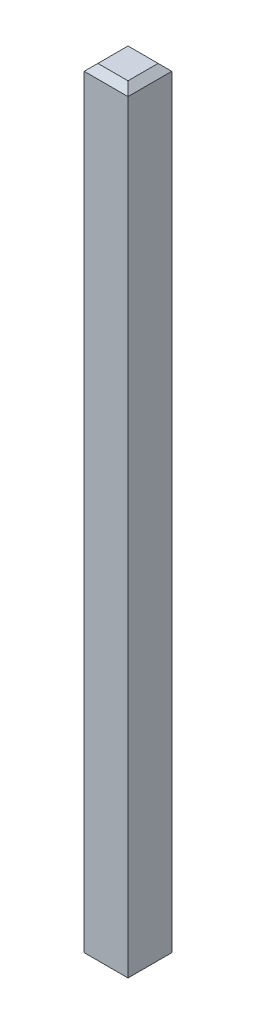
ISO-10303-21;
HEADER;
FILE_DESCRIPTION(('STEP AP214'),'2;1');
FILE_NAME('part.step','',(''),(''),'','','');
FILE_SCHEMA(('AUTOMOTIVE_DESIGN { 1 0 10303 214 1 1 1 1 }'));
ENDSEC;
DATA;
#1=APPLICATION_CONTEXT('core data for automotive mechanical design processes');
#2=APPLICATION_PROTOCOL_DEFINITION('international standard','automotive_design',2000,#1);
#3=PRODUCT_CONTEXT('',#1,'mechanical');
#4=PRODUCT('Part','Part','',(#3));
#5=PRODUCT_RELATED_PRODUCT_CATEGORY('part','',(#4));
#6=PRODUCT_DEFINITION_FORMATION('','',#4);
#7=PRODUCT_DEFINITION_CONTEXT('part definition',#1,'design');
#8=PRODUCT_DEFINITION('design','',#6,#7);
#9=PRODUCT_DEFINITION_SHAPE('','',#8);
#10=(LENGTH_UNIT() NAMED_UNIT(*) SI_UNIT(.MILLI.,.METRE.));
#11=(NAMED_UNIT(*) PLANE_ANGLE_UNIT() SI_UNIT($,.RADIAN.));
#12=(NAMED_UNIT(*) SI_UNIT($,.STERADIAN.) SOLID_ANGLE_UNIT());
#13=UNCERTAINTY_MEASURE_WITH_UNIT(LENGTH_MEASURE(1.E-05),#10,'distance_accuracy_value','');
#14=(GEOMETRIC_REPRESENTATION_CONTEXT(3) GLOBAL_UNCERTAINTY_ASSIGNED_CONTEXT((#13)) GLOBAL_UNIT_ASSIGNED_CONTEXT((#10,
#11,#12)) REPRESENTATION_CONTEXT('',''));
#15=CARTESIAN_POINT('',(0.,0.,0.));
#16=DIRECTION('',(0.,0.,1.));
#17=DIRECTION('',(1.,0.,0.));
#18=AXIS2_PLACEMENT_3D('',#15,#16,#17);
#19=CARTESIAN_POINT('',(0.320000000000001,11.35,-0.32));
#20=DIRECTION('',(-1.,0.,0.));
#21=DIRECTION('',(0.,0.,1.));
#22=AXIS2_PLACEMENT_3D('',#19,#20,#21);
#23=PLANE('',#22);
#24=DIRECTION('',(0.,-1.,0.));
#25=VECTOR('',#24,1.);
#26=CARTESIAN_POINT('',(0.320000000000001,11.35,0.32));
#27=LINE('',#26,#25);
#28=CARTESIAN_POINT('',(0.320000000000001,11.25,0.32));
#29=VERTEX_POINT('',#28);
#30=CARTESIAN_POINT('',(0.320000000000001,0.0999999999999994,0.32));
#31=VERTEX_POINT('',#30);
#32=EDGE_CURVE('E133',#29,#31,#27,.T.);
#33=ORIENTED_EDGE('',*,*,#32,.T.);
#34=DIRECTION('',(0.,0.,-1.));
#35=VECTOR('',#34,1.);
#36=CARTESIAN_POINT('',(0.320000000000001,0.0999999999999994,-0.32));
#37=LINE('',#36,#35);
#38=CARTESIAN_POINT('',(0.320000000000001,0.0999999999999994,-0.32));
#39=VERTEX_POINT('',#38);
#40=EDGE_CURVE('E153',#31,#39,#37,.T.);
#41=ORIENTED_EDGE('',*,*,#40,.T.);
#42=DIRECTION('',(0.,-1.,0.));
#43=VECTOR('',#42,1.);
#44=CARTESIAN_POINT('',(0.320000000000001,11.35,-0.32));
#45=LINE('',#44,#43);
#46=CARTESIAN_POINT('',(0.320000000000001,11.25,-0.32));
#47=VERTEX_POINT('',#46);
#48=EDGE_CURVE('E116',#47,#39,#45,.T.);
#49=ORIENTED_EDGE('',*,*,#48,.F.);
#50=DIRECTION('',(0.,0.,1.));
#51=VECTOR('',#50,1.);
#52=CARTESIAN_POINT('',(0.320000000000001,11.25,0.32));
#53=LINE('',#52,#51);
#54=EDGE_CURVE('E151',#47,#29,#53,.T.);
#55=ORIENTED_EDGE('',*,*,#54,.T.);
#56=EDGE_LOOP('',(#33,#41,#49,#55));
#57=FACE_BOUND('',#56,.T.);
#58=ADVANCED_FACE('F33',(#57),#23,.F.);
#59=CARTESIAN_POINT('',(-0.319999999999999,11.35,-0.32));
#60=DIRECTION('',(0.,0.,1.));
#61=DIRECTION('',(1.,0.,0.));
#62=AXIS2_PLACEMENT_3D('',#59,#60,#61);
#63=PLANE('',#62);
#64=ORIENTED_EDGE('',*,*,#48,.T.);
#65=DIRECTION('',(-1.,0.,0.));
#66=VECTOR('',#65,1.);
#67=CARTESIAN_POINT('',(-0.319999999999999,0.0999999999999994,-0.32));
#68=LINE('',#67,#66);
#69=CARTESIAN_POINT('',(-0.319999999999999,0.0999999999999994,-0.32));
#70=VERTEX_POINT('',#69);
#71=EDGE_CURVE('E115',#39,#70,#68,.T.);
#72=ORIENTED_EDGE('',*,*,#71,.T.);
#73=DIRECTION('',(0.,-1.,0.));
#74=VECTOR('',#73,1.);
#75=CARTESIAN_POINT('',(-0.319999999999999,11.35,-0.32));
#76=LINE('',#75,#74);
#77=CARTESIAN_POINT('',(-0.319999999999999,11.25,-0.32));
#78=VERTEX_POINT('',#77);
#79=EDGE_CURVE('E122',#78,#70,#76,.T.);
#80=ORIENTED_EDGE('',*,*,#79,.F.);
#81=DIRECTION('',(1.,0.,0.));
#82=VECTOR('',#81,1.);
#83=CARTESIAN_POINT('',(0.320000000000001,11.25,-0.32));
#84=LINE('',#83,#82);
#85=EDGE_CURVE('E109',#78,#47,#84,.T.);
#86=ORIENTED_EDGE('',*,*,#85,.T.);
#87=EDGE_LOOP('',(#64,#72,#80,#86));
#88=FACE_BOUND('',#87,.T.);
#89=ADVANCED_FACE('F129',(#88),#63,.F.);
#90=CARTESIAN_POINT('',(-0.319999999999999,11.35,-0.32));
#91=DIRECTION('',(1.,0.,0.));
#92=DIRECTION('',(0.,0.,-1.));
#93=AXIS2_PLACEMENT_3D('',#90,#91,#92);
#94=PLANE('',#93);
#95=ORIENTED_EDGE('',*,*,#79,.T.);
#96=DIRECTION('',(0.,0.,1.));
#97=VECTOR('',#96,1.);
#98=CARTESIAN_POINT('',(-0.319999999999999,0.0999999999999994,-0.32));
#99=LINE('',#98,#97);
#100=CARTESIAN_POINT('',(-0.319999999999999,0.0999999999999994,0.32));
#101=VERTEX_POINT('',#100);
#102=EDGE_CURVE('E125',#70,#101,#99,.T.);
#103=ORIENTED_EDGE('',*,*,#102,.T.);
#104=DIRECTION('',(0.,-1.,0.));
#105=VECTOR('',#104,1.);
#106=CARTESIAN_POINT('',(-0.319999999999999,11.35,0.32));
#107=LINE('',#106,#105);
#108=CARTESIAN_POINT('',(-0.319999999999999,11.25,0.32));
#109=VERTEX_POINT('',#108);
#110=EDGE_CURVE('E124',#109,#101,#107,.T.);
#111=ORIENTED_EDGE('',*,*,#110,.F.);
#112=DIRECTION('',(0.,0.,-1.));
#113=VECTOR('',#112,1.);
#114=CARTESIAN_POINT('',(-0.319999999999999,11.25,-0.32));
#115=LINE('',#114,#113);
#116=EDGE_CURVE('E102',#109,#78,#115,.T.);
#117=ORIENTED_EDGE('',*,*,#116,.T.);
#118=EDGE_LOOP('',(#95,#103,#111,#117));
#119=FACE_BOUND('',#118,.T.);
#120=ADVANCED_FACE('F121',(#119),#94,.F.);
#121=CARTESIAN_POINT('',(-0.319999999999999,11.35,0.32));
#122=DIRECTION('',(0.,0.,-1.));
#123=DIRECTION('',(-1.,0.,0.));
#124=AXIS2_PLACEMENT_3D('',#121,#122,#123);
#125=PLANE('',#124);
#126=ORIENTED_EDGE('',*,*,#110,.T.);
#127=DIRECTION('',(1.,0.,0.));
#128=VECTOR('',#127,1.);
#129=CARTESIAN_POINT('',(-0.319999999999999,0.0999999999999994,0.32));
#130=LINE('',#129,#128);
#131=EDGE_CURVE('E149',#101,#31,#130,.T.);
#132=ORIENTED_EDGE('',*,*,#131,.T.);
#133=ORIENTED_EDGE('',*,*,#32,.F.);
#134=DIRECTION('',(-1.,0.,0.));
#135=VECTOR('',#134,1.);
#136=CARTESIAN_POINT('',(-0.319999999999999,11.25,0.32));
#137=LINE('',#136,#135);
#138=EDGE_CURVE('E147',#29,#109,#137,.T.);
#139=ORIENTED_EDGE('',*,*,#138,.T.);
#140=EDGE_LOOP('',(#126,#132,#133,#139));
#141=FACE_BOUND('',#140,.T.);
#142=ADVANCED_FACE('F182',(#141),#125,.F.);
#143=CARTESIAN_POINT('',(0.,11.35,0.));
#144=DIRECTION('',(0.,1.,0.));
#145=DIRECTION('',(0.,0.,1.));
#146=AXIS2_PLACEMENT_3D('',#143,#144,#145);
#147=PLANE('',#146);
#148=DIRECTION('',(-1.,0.,0.));
#149=VECTOR('',#148,1.);
#150=CARTESIAN_POINT('',(-0.319999999999999,11.35,-0.219999999999999));
#151=LINE('',#150,#149);
#152=CARTESIAN_POINT('',(0.22,11.35,-0.219999999999999));
#153=VERTEX_POINT('',#152);
#154=CARTESIAN_POINT('',(-0.219999999999998,11.35,-0.219999999999999));
#155=VERTEX_POINT('',#154);
#156=EDGE_CURVE('E42',#153,#155,#151,.T.);
#157=ORIENTED_EDGE('',*,*,#156,.T.);
#158=DIRECTION('',(0.,0.,1.));
#159=VECTOR('',#158,1.);
#160=CARTESIAN_POINT('',(-0.219999999999998,11.35,0.32));
#161=LINE('',#160,#159);
#162=CARTESIAN_POINT('',(-0.219999999999998,11.35,0.219999999999999));
#163=VERTEX_POINT('',#162);
#164=EDGE_CURVE('E11',#155,#163,#161,.T.);
#165=ORIENTED_EDGE('',*,*,#164,.T.);
#166=DIRECTION('',(1.,0.,0.));
#167=VECTOR('',#166,1.);
#168=CARTESIAN_POINT('',(0.320000000000001,11.35,0.219999999999999));
#169=LINE('',#168,#167);
#170=CARTESIAN_POINT('',(0.22,11.35,0.219999999999999));
#171=VERTEX_POINT('',#170);
#172=EDGE_CURVE('E155',#163,#171,#169,.T.);
#173=ORIENTED_EDGE('',*,*,#172,.T.);
#174=DIRECTION('',(0.,0.,-1.));
#175=VECTOR('',#174,1.);
#176=CARTESIAN_POINT('',(0.22,11.35,-0.32));
#177=LINE('',#176,#175);
#178=EDGE_CURVE('E53',#171,#153,#177,.T.);
#179=ORIENTED_EDGE('',*,*,#178,.T.);
#180=EDGE_LOOP('',(#157,#165,#173,#179));
#181=FACE_BOUND('',#180,.T.);
#182=ADVANCED_FACE('F275',(#181),#147,.T.);
#183=CARTESIAN_POINT('',(0.,0.,0.));
#184=DIRECTION('',(0.,1.,0.));
#185=DIRECTION('',(0.,0.,1.));
#186=AXIS2_PLACEMENT_3D('',#183,#184,#185);
#187=PLANE('',#186);
#188=DIRECTION('',(0.,0.,-1.));
#189=VECTOR('',#188,1.);
#190=CARTESIAN_POINT('',(-0.220000000000001,0.,0.));
#191=LINE('',#190,#189);
#192=CARTESIAN_POINT('',(-0.220000000000001,0.,0.220000000000002));
#193=VERTEX_POINT('',#192);
#194=CARTESIAN_POINT('',(-0.220000000000001,0.,-0.220000000000002));
#195=VERTEX_POINT('',#194);
#196=EDGE_CURVE('E142',#193,#195,#191,.T.);
#197=ORIENTED_EDGE('',*,*,#196,.T.);
#198=DIRECTION('',(1.,0.,0.));
#199=VECTOR('',#198,1.);
#200=CARTESIAN_POINT('',(0.,0.,-0.220000000000002));
#201=LINE('',#200,#199);
#202=CARTESIAN_POINT('',(0.220000000000003,0.,-0.220000000000002));
#203=VERTEX_POINT('',#202);
#204=EDGE_CURVE('E126',#195,#203,#201,.T.);
#205=ORIENTED_EDGE('',*,*,#204,.T.);
#206=DIRECTION('',(0.,0.,1.));
#207=VECTOR('',#206,1.);
#208=CARTESIAN_POINT('',(0.220000000000003,0.,0.));
#209=LINE('',#208,#207);
#210=CARTESIAN_POINT('',(0.220000000000003,0.,0.220000000000002));
#211=VERTEX_POINT('',#210);
#212=EDGE_CURVE('E138',#203,#211,#209,.T.);
#213=ORIENTED_EDGE('',*,*,#212,.T.);
#214=DIRECTION('',(-1.,0.,0.));
#215=VECTOR('',#214,1.);
#216=CARTESIAN_POINT('',(0.,0.,0.220000000000002));
#217=LINE('',#216,#215);
#218=EDGE_CURVE('E140',#211,#193,#217,.T.);
#219=ORIENTED_EDGE('',*,*,#218,.T.);
#220=EDGE_LOOP('',(#197,#205,#213,#219));
#221=FACE_BOUND('',#220,.T.);
#222=ADVANCED_FACE('F196',(#221),#187,.F.);
#223=CARTESIAN_POINT('',(-0.319999999999999,0.0999999999999994,0.32));
#224=DIRECTION('',(0.,0.707106781186541,-0.707106781186554));
#225=DIRECTION('',(1.,0.,0.));
#226=AXIS2_PLACEMENT_3D('',#223,#224,#225);
#227=PLANE('',#226);
#228=DIRECTION('',(0.577350269189622,-0.577350269189632,-0.577350269189622));
#229=VECTOR('',#228,1.);
#230=CARTESIAN_POINT('',(-0.319999999999999,0.0999999999999994,0.32));
#231=LINE('',#230,#229);
#232=EDGE_CURVE('E163',#193,#101,#231,.F.);
#233=ORIENTED_EDGE('',*,*,#232,.F.);
#234=ORIENTED_EDGE('',*,*,#218,.F.);
#235=DIRECTION('',(-0.577350269189622,-0.577350269189632,-0.577350269189622));
#236=VECTOR('',#235,1.);
#237=CARTESIAN_POINT('',(0.10666666666667,-0.113333333333335,0.106666666666669));
#238=LINE('',#237,#236);
#239=EDGE_CURVE('E166',#31,#211,#238,.T.);
#240=ORIENTED_EDGE('',*,*,#239,.F.);
#241=ORIENTED_EDGE('',*,*,#131,.F.);
#242=EDGE_LOOP('',(#233,#234,#240,#241));
#243=FACE_BOUND('',#242,.T.);
#244=ADVANCED_FACE('F186',(#243),#227,.F.);
#245=CARTESIAN_POINT('',(0.320000000000001,0.0999999999999994,-0.32));
#246=DIRECTION('',(-0.707106781186554,0.707106781186541,0.));
#247=DIRECTION('',(0.,0.,-1.));
#248=AXIS2_PLACEMENT_3D('',#245,#246,#247);
#249=PLANE('',#248);
#250=ORIENTED_EDGE('',*,*,#239,.T.);
#251=ORIENTED_EDGE('',*,*,#212,.F.);
#252=DIRECTION('',(0.577350269189622,0.577350269189632,-0.577350269189622));
#253=VECTOR('',#252,1.);
#254=CARTESIAN_POINT('',(0.320000000000001,0.0999999999999994,-0.32));
#255=LINE('',#254,#253);
#256=EDGE_CURVE('E161',#39,#203,#255,.F.);
#257=ORIENTED_EDGE('',*,*,#256,.F.);
#258=ORIENTED_EDGE('',*,*,#40,.F.);
#259=EDGE_LOOP('',(#250,#251,#257,#258));
#260=FACE_BOUND('',#259,.T.);
#261=ADVANCED_FACE('F202',(#260),#249,.F.);
#262=CARTESIAN_POINT('',(-0.319999999999999,0.0999999999999994,-0.32));
#263=DIRECTION('',(0.707106781186554,0.707106781186541,0.));
#264=DIRECTION('',(0.,0.,1.));
#265=AXIS2_PLACEMENT_3D('',#262,#263,#264);
#266=PLANE('',#265);
#267=ORIENTED_EDGE('',*,*,#232,.T.);
#268=ORIENTED_EDGE('',*,*,#102,.F.);
#269=DIRECTION('',(0.577350269189622,-0.577350269189632,0.577350269189622));
#270=VECTOR('',#269,1.);
#271=CARTESIAN_POINT('',(-0.319999999999999,0.0999999999999994,-0.32));
#272=LINE('',#271,#270);
#273=EDGE_CURVE('E159',#195,#70,#272,.F.);
#274=ORIENTED_EDGE('',*,*,#273,.F.);
#275=ORIENTED_EDGE('',*,*,#196,.F.);
#276=EDGE_LOOP('',(#267,#268,#274,#275));
#277=FACE_BOUND('',#276,.T.);
#278=ADVANCED_FACE('F192',(#277),#266,.F.);
#279=CARTESIAN_POINT('',(-0.319999999999999,0.0999999999999994,-0.32));
#280=DIRECTION('',(0.,0.707106781186541,0.707106781186554));
#281=DIRECTION('',(-1.,0.,0.));
#282=AXIS2_PLACEMENT_3D('',#279,#280,#281);
#283=PLANE('',#282);
#284=ORIENTED_EDGE('',*,*,#256,.T.);
#285=ORIENTED_EDGE('',*,*,#204,.F.);
#286=ORIENTED_EDGE('',*,*,#273,.T.);
#287=ORIENTED_EDGE('',*,*,#71,.F.);
#288=EDGE_LOOP('',(#284,#285,#286,#287));
#289=FACE_BOUND('',#288,.T.);
#290=ADVANCED_FACE('F198',(#289),#283,.F.);
#291=CARTESIAN_POINT('',(0.22,11.35,0.));
#292=DIRECTION('',(0.707106781186547,0.707106781186547,0.));
#293=DIRECTION('',(0.,0.,1.));
#294=AXIS2_PLACEMENT_3D('',#291,#292,#293);
#295=PLANE('',#294);
#296=DIRECTION('',(-0.577350269189626,0.577350269189626,-0.577350269189626));
#297=VECTOR('',#296,1.);
#298=CARTESIAN_POINT('',(0.146666666666666,11.4233333333333,0.146666666666666));
#299=LINE('',#298,#297);
#300=EDGE_CURVE('E105',#29,#171,#299,.T.);
#301=ORIENTED_EDGE('',*,*,#300,.F.);
#302=ORIENTED_EDGE('',*,*,#54,.F.);
#303=DIRECTION('',(-0.577350269189626,0.577350269189626,0.577350269189626));
#304=VECTOR('',#303,1.);
#305=CARTESIAN_POINT('',(0.146666666666667,11.4233333333333,-0.146666666666666));
#306=LINE('',#305,#304);
#307=EDGE_CURVE('E37',#153,#47,#306,.F.);
#308=ORIENTED_EDGE('',*,*,#307,.F.);
#309=ORIENTED_EDGE('',*,*,#178,.F.);
#310=EDGE_LOOP('',(#301,#302,#308,#309));
#311=FACE_BOUND('',#310,.T.);
#312=ADVANCED_FACE('F35',(#311),#295,.T.);
#313=CARTESIAN_POINT('',(0.,11.35,-0.219999999999999));
#314=DIRECTION('',(0.,0.707106781186547,-0.707106781186547));
#315=DIRECTION('',(1.,0.,0.));
#316=AXIS2_PLACEMENT_3D('',#313,#314,#315);
#317=PLANE('',#316);
#318=ORIENTED_EDGE('',*,*,#307,.T.);
#319=ORIENTED_EDGE('',*,*,#85,.F.);
#320=DIRECTION('',(0.577350269189626,0.577350269189626,0.577350269189626));
#321=VECTOR('',#320,1.);
#322=CARTESIAN_POINT('',(-0.146666666666665,11.4233333333333,-0.146666666666666));
#323=LINE('',#322,#321);
#324=EDGE_CURVE('E98',#155,#78,#323,.F.);
#325=ORIENTED_EDGE('',*,*,#324,.F.);
#326=ORIENTED_EDGE('',*,*,#156,.F.);
#327=EDGE_LOOP('',(#318,#319,#325,#326));
#328=FACE_BOUND('',#327,.T.);
#329=ADVANCED_FACE('F110',(#328),#317,.T.);
#330=CARTESIAN_POINT('',(0.,11.35,0.219999999999999));
#331=DIRECTION('',(0.,0.707106781186547,0.707106781186547));
#332=DIRECTION('',(-1.,0.,0.));
#333=AXIS2_PLACEMENT_3D('',#330,#331,#332);
#334=PLANE('',#333);
#335=ORIENTED_EDGE('',*,*,#300,.T.);
#336=ORIENTED_EDGE('',*,*,#172,.F.);
#337=DIRECTION('',(-0.577350269189626,-0.577350269189626,0.577350269189626));
#338=VECTOR('',#337,1.);
#339=CARTESIAN_POINT('',(-0.146666666666665,11.4233333333333,0.146666666666666));
#340=LINE('',#339,#338);
#341=EDGE_CURVE('E106',#109,#163,#340,.F.);
#342=ORIENTED_EDGE('',*,*,#341,.F.);
#343=ORIENTED_EDGE('',*,*,#138,.F.);
#344=EDGE_LOOP('',(#335,#336,#342,#343));
#345=FACE_BOUND('',#344,.T.);
#346=ADVANCED_FACE('F174',(#345),#334,.T.);
#347=CARTESIAN_POINT('',(-0.219999999999998,11.35,0.));
#348=DIRECTION('',(-0.707106781186547,0.707106781186547,0.));
#349=DIRECTION('',(0.,0.,-1.));
#350=AXIS2_PLACEMENT_3D('',#347,#348,#349);
#351=PLANE('',#350);
#352=ORIENTED_EDGE('',*,*,#324,.T.);
#353=ORIENTED_EDGE('',*,*,#116,.F.);
#354=ORIENTED_EDGE('',*,*,#341,.T.);
#355=ORIENTED_EDGE('',*,*,#164,.F.);
#356=EDGE_LOOP('',(#352,#353,#354,#355));
#357=FACE_BOUND('',#356,.T.);
#358=ADVANCED_FACE('F100',(#357),#351,.T.);
#359=CLOSED_SHELL('',(#58,#89,#120,#142,#182,#222,#244,#261,#278,#290,#312,#329,#346,#358));
#360=MANIFOLD_SOLID_BREP('B2',#359);
#361=ADVANCED_BREP_SHAPE_REPRESENTATION('',(#18,#360),#14);
#362=SHAPE_DEFINITION_REPRESENTATION(#9,#361);
ENDSEC;
END-ISO-10303-21;
